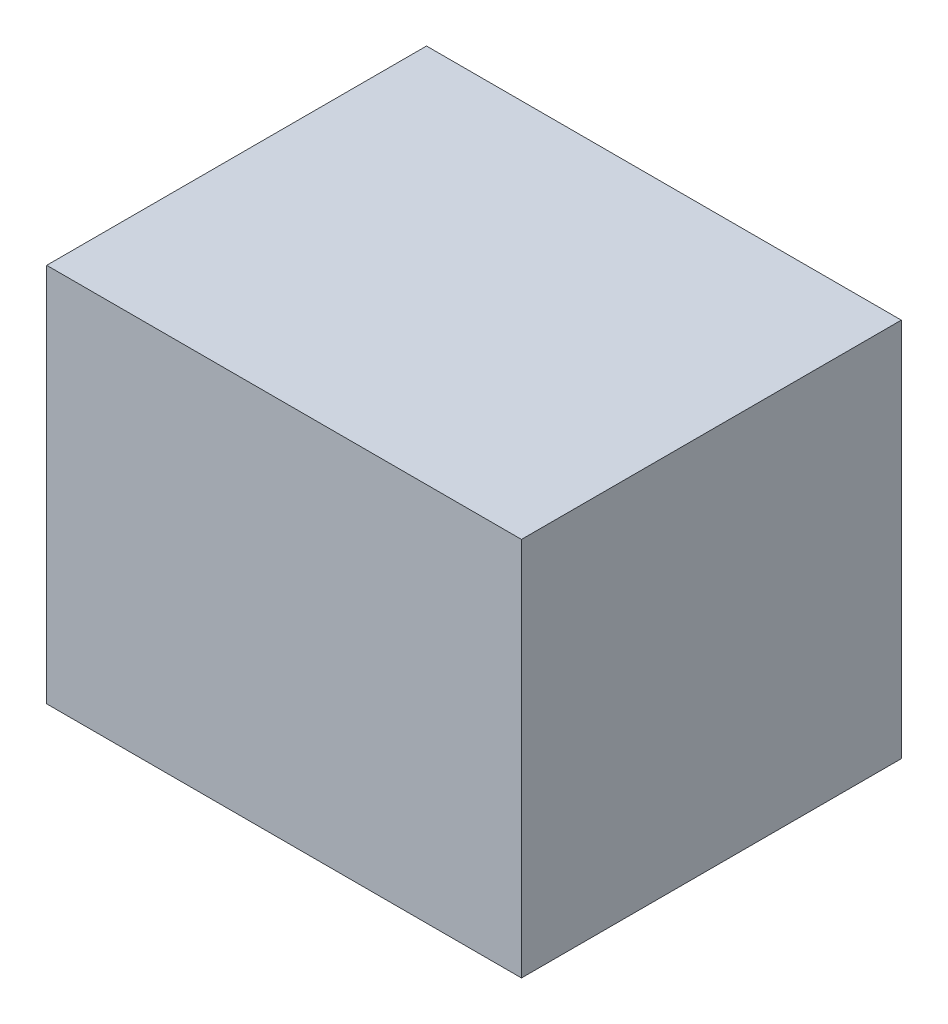
ISO-10303-21;
HEADER;
FILE_DESCRIPTION(('STEP AP214'),'2;1');
FILE_NAME('part.step','',(''),(''),'','','');
FILE_SCHEMA(('AUTOMOTIVE_DESIGN { 1 0 10303 214 1 1 1 1 }'));
ENDSEC;
DATA;
#1=APPLICATION_CONTEXT('core data for automotive mechanical design processes');
#2=APPLICATION_PROTOCOL_DEFINITION('international standard','automotive_design',2000,#1);
#3=PRODUCT_CONTEXT('',#1,'mechanical');
#4=PRODUCT('Part','Part','',(#3));
#5=PRODUCT_RELATED_PRODUCT_CATEGORY('part','',(#4));
#6=PRODUCT_DEFINITION_FORMATION('','',#4);
#7=PRODUCT_DEFINITION_CONTEXT('part definition',#1,'design');
#8=PRODUCT_DEFINITION('design','',#6,#7);
#9=PRODUCT_DEFINITION_SHAPE('','',#8);
#10=(LENGTH_UNIT() NAMED_UNIT(*) SI_UNIT(.MILLI.,.METRE.));
#11=(NAMED_UNIT(*) PLANE_ANGLE_UNIT() SI_UNIT($,.RADIAN.));
#12=(NAMED_UNIT(*) SI_UNIT($,.STERADIAN.) SOLID_ANGLE_UNIT());
#13=UNCERTAINTY_MEASURE_WITH_UNIT(LENGTH_MEASURE(1.E-05),#10,'distance_accuracy_value','');
#14=(GEOMETRIC_REPRESENTATION_CONTEXT(3) GLOBAL_UNCERTAINTY_ASSIGNED_CONTEXT((#13)) GLOBAL_UNIT_ASSIGNED_CONTEXT((#10,
#11,#12)) REPRESENTATION_CONTEXT('',''));
#15=CARTESIAN_POINT('',(0.,0.,0.));
#16=DIRECTION('',(0.,0.,1.));
#17=DIRECTION('',(1.,0.,0.));
#18=AXIS2_PLACEMENT_3D('',#15,#16,#17);
#19=CARTESIAN_POINT('',(-250.,30.,60.));
#20=DIRECTION('',(0.,-1.,0.));
#21=DIRECTION('',(0.,0.,-1.));
#22=AXIS2_PLACEMENT_3D('',#19,#20,#21);
#23=PLANE('',#22);
#24=DIRECTION('',(0.,0.,-1.));
#25=VECTOR('',#24,1.);
#26=CARTESIAN_POINT('',(-225.,30.,0.));
#27=LINE('',#26,#25);
#28=CARTESIAN_POINT('',(-225.,30.,60.));
#29=VERTEX_POINT('',#28);
#30=CARTESIAN_POINT('',(-225.,30.,0.));
#31=VERTEX_POINT('',#30);
#32=EDGE_CURVE('E50',#29,#31,#27,.T.);
#33=ORIENTED_EDGE('',*,*,#32,.F.);
#34=DIRECTION('',(-1.,0.,0.));
#35=VECTOR('',#34,1.);
#36=CARTESIAN_POINT('',(-250.,30.,60.));
#37=LINE('',#36,#35);
#38=CARTESIAN_POINT('',(-150.,30.,60.));
#39=VERTEX_POINT('',#38);
#40=EDGE_CURVE('E42',#39,#29,#37,.T.);
#41=ORIENTED_EDGE('',*,*,#40,.F.);
#42=DIRECTION('',(0.,0.,1.));
#43=VECTOR('',#42,1.);
#44=CARTESIAN_POINT('',(-150.,30.,60.));
#45=LINE('',#44,#43);
#46=CARTESIAN_POINT('',(-150.,30.,0.));
#47=VERTEX_POINT('',#46);
#48=EDGE_CURVE('E58',#47,#39,#45,.T.);
#49=ORIENTED_EDGE('',*,*,#48,.F.);
#50=DIRECTION('',(-1.,0.,0.));
#51=VECTOR('',#50,1.);
#52=CARTESIAN_POINT('',(-250.,30.,0.));
#53=LINE('',#52,#51);
#54=EDGE_CURVE('E93',#47,#31,#53,.T.);
#55=ORIENTED_EDGE('',*,*,#54,.T.);
#56=EDGE_LOOP('',(#33,#41,#49,#55));
#57=FACE_BOUND('',#56,.T.);
#58=ADVANCED_FACE('F33',(#57),#23,.F.);
#59=CARTESIAN_POINT('',(-250.,-30.,60.));
#60=DIRECTION('',(0.,1.,0.));
#61=DIRECTION('',(0.,0.,1.));
#62=AXIS2_PLACEMENT_3D('',#59,#60,#61);
#63=PLANE('',#62);
#64=DIRECTION('',(0.,0.,1.));
#65=VECTOR('',#64,1.);
#66=CARTESIAN_POINT('',(-225.,-30.,0.));
#67=LINE('',#66,#65);
#68=CARTESIAN_POINT('',(-225.,-30.,0.));
#69=VERTEX_POINT('',#68);
#70=CARTESIAN_POINT('',(-225.,-30.,60.));
#71=VERTEX_POINT('',#70);
#72=EDGE_CURVE('E76',#69,#71,#67,.T.);
#73=ORIENTED_EDGE('',*,*,#72,.F.);
#74=DIRECTION('',(1.,0.,0.));
#75=VECTOR('',#74,1.);
#76=CARTESIAN_POINT('',(-250.,-30.,0.));
#77=LINE('',#76,#75);
#78=CARTESIAN_POINT('',(-150.,-30.,0.));
#79=VERTEX_POINT('',#78);
#80=EDGE_CURVE('E37',#69,#79,#77,.T.);
#81=ORIENTED_EDGE('',*,*,#80,.T.);
#82=DIRECTION('',(0.,0.,-1.));
#83=VECTOR('',#82,1.);
#84=CARTESIAN_POINT('',(-150.,-30.,60.));
#85=LINE('',#84,#83);
#86=CARTESIAN_POINT('',(-150.,-30.,60.));
#87=VERTEX_POINT('',#86);
#88=EDGE_CURVE('E103',#87,#79,#85,.T.);
#89=ORIENTED_EDGE('',*,*,#88,.F.);
#90=DIRECTION('',(1.,0.,0.));
#91=VECTOR('',#90,1.);
#92=CARTESIAN_POINT('',(-250.,-30.,60.));
#93=LINE('',#92,#91);
#94=EDGE_CURVE('E11',#71,#87,#93,.T.);
#95=ORIENTED_EDGE('',*,*,#94,.F.);
#96=EDGE_LOOP('',(#73,#81,#89,#95));
#97=FACE_BOUND('',#96,.T.);
#98=ADVANCED_FACE('F85',(#97),#63,.F.);
#99=CARTESIAN_POINT('',(0.,0.,60.));
#100=DIRECTION('',(0.,0.,1.));
#101=DIRECTION('',(1.,0.,0.));
#102=AXIS2_PLACEMENT_3D('',#99,#100,#101);
#103=PLANE('',#102);
#104=ORIENTED_EDGE('',*,*,#40,.T.);
#105=DIRECTION('',(0.,1.,0.));
#106=VECTOR('',#105,1.);
#107=CARTESIAN_POINT('',(-225.,30.,60.));
#108=LINE('',#107,#106);
#109=EDGE_CURVE('E88',#71,#29,#108,.T.);
#110=ORIENTED_EDGE('',*,*,#109,.F.);
#111=ORIENTED_EDGE('',*,*,#94,.T.);
#112=DIRECTION('',(0.,-1.,0.));
#113=VECTOR('',#112,1.);
#114=CARTESIAN_POINT('',(-150.,30.,60.));
#115=LINE('',#114,#113);
#116=EDGE_CURVE('E105',#39,#87,#115,.T.);
#117=ORIENTED_EDGE('',*,*,#116,.F.);
#118=EDGE_LOOP('',(#104,#110,#111,#117));
#119=FACE_BOUND('',#118,.T.);
#120=ADVANCED_FACE('F110',(#119),#103,.T.);
#121=CARTESIAN_POINT('',(0.,0.,0.));
#122=DIRECTION('',(0.,0.,1.));
#123=DIRECTION('',(1.,0.,0.));
#124=AXIS2_PLACEMENT_3D('',#121,#122,#123);
#125=PLANE('',#124);
#126=CARTESIAN_POINT('',(-187.5,0.,0.));
#127=DIRECTION('',(0.,0.,-1.));
#128=DIRECTION('',(-1.,0.,0.));
#129=AXIS2_PLACEMENT_3D('',#126,#127,#128);
#130=CIRCLE('',#129,25.);
#131=CARTESIAN_POINT('',(-212.5,0.,0.));
#132=VERTEX_POINT('',#131);
#133=EDGE_CURVE('E96',#132,#132,#130,.T.);
#134=ORIENTED_EDGE('',*,*,#133,.F.);
#135=EDGE_LOOP('',(#134));
#136=FACE_BOUND('',#135,.T.);
#137=DIRECTION('',(0.,-1.,0.));
#138=VECTOR('',#137,1.);
#139=CARTESIAN_POINT('',(-225.,30.,0.));
#140=LINE('',#139,#138);
#141=EDGE_CURVE('E73',#31,#69,#140,.T.);
#142=ORIENTED_EDGE('',*,*,#141,.F.);
#143=ORIENTED_EDGE('',*,*,#54,.F.);
#144=DIRECTION('',(0.,1.,0.));
#145=VECTOR('',#144,1.);
#146=CARTESIAN_POINT('',(-150.,30.,0.));
#147=LINE('',#146,#145);
#148=EDGE_CURVE('E92',#79,#47,#147,.T.);
#149=ORIENTED_EDGE('',*,*,#148,.F.);
#150=ORIENTED_EDGE('',*,*,#80,.F.);
#151=EDGE_LOOP('',(#142,#143,#149,#150));
#152=FACE_BOUND('',#151,.T.);
#153=ADVANCED_FACE('F91',(#136,#152),#125,.F.);
#154=CARTESIAN_POINT('',(-187.5,0.,1.00024155624823E-11));
#155=DIRECTION('',(0.,0.,1.));
#156=DIRECTION('',(1.,0.,0.));
#157=AXIS2_PLACEMENT_3D('',#154,#155,#156);
#158=SPHERICAL_SURFACE('',#157,24.99999999999);
#159=ORIENTED_EDGE('',*,*,#133,.T.);
#160=EDGE_LOOP('',(#159));
#161=FACE_BOUND('',#160,.T.);
#162=ADVANCED_FACE('F35',(#161),#158,.F.);
#163=CARTESIAN_POINT('',(-150.,0.,0.));
#164=DIRECTION('',(1.,0.,0.));
#165=DIRECTION('',(0.,0.,-1.));
#166=AXIS2_PLACEMENT_3D('',#163,#164,#165);
#167=PLANE('',#166);
#168=ORIENTED_EDGE('',*,*,#116,.T.);
#169=ORIENTED_EDGE('',*,*,#88,.T.);
#170=ORIENTED_EDGE('',*,*,#148,.T.);
#171=ORIENTED_EDGE('',*,*,#48,.T.);
#172=EDGE_LOOP('',(#168,#169,#170,#171));
#173=FACE_BOUND('',#172,.T.);
#174=ADVANCED_FACE('F111',(#173),#167,.T.);
#175=CARTESIAN_POINT('',(-225.,0.,0.));
#176=DIRECTION('',(-1.,0.,0.));
#177=DIRECTION('',(0.,0.,1.));
#178=AXIS2_PLACEMENT_3D('',#175,#176,#177);
#179=PLANE('',#178);
#180=ORIENTED_EDGE('',*,*,#141,.T.);
#181=ORIENTED_EDGE('',*,*,#72,.T.);
#182=ORIENTED_EDGE('',*,*,#109,.T.);
#183=ORIENTED_EDGE('',*,*,#32,.T.);
#184=EDGE_LOOP('',(#180,#181,#182,#183));
#185=FACE_BOUND('',#184,.T.);
#186=ADVANCED_FACE('F75',(#185),#179,.T.);
#187=CLOSED_SHELL('',(#58,#98,#120,#153,#162,#174,#186));
#188=MANIFOLD_SOLID_BREP('B2',#187);
#189=ADVANCED_BREP_SHAPE_REPRESENTATION('',(#18,#188),#14);
#190=SHAPE_DEFINITION_REPRESENTATION(#9,#189);
ENDSEC;
END-ISO-10303-21;
